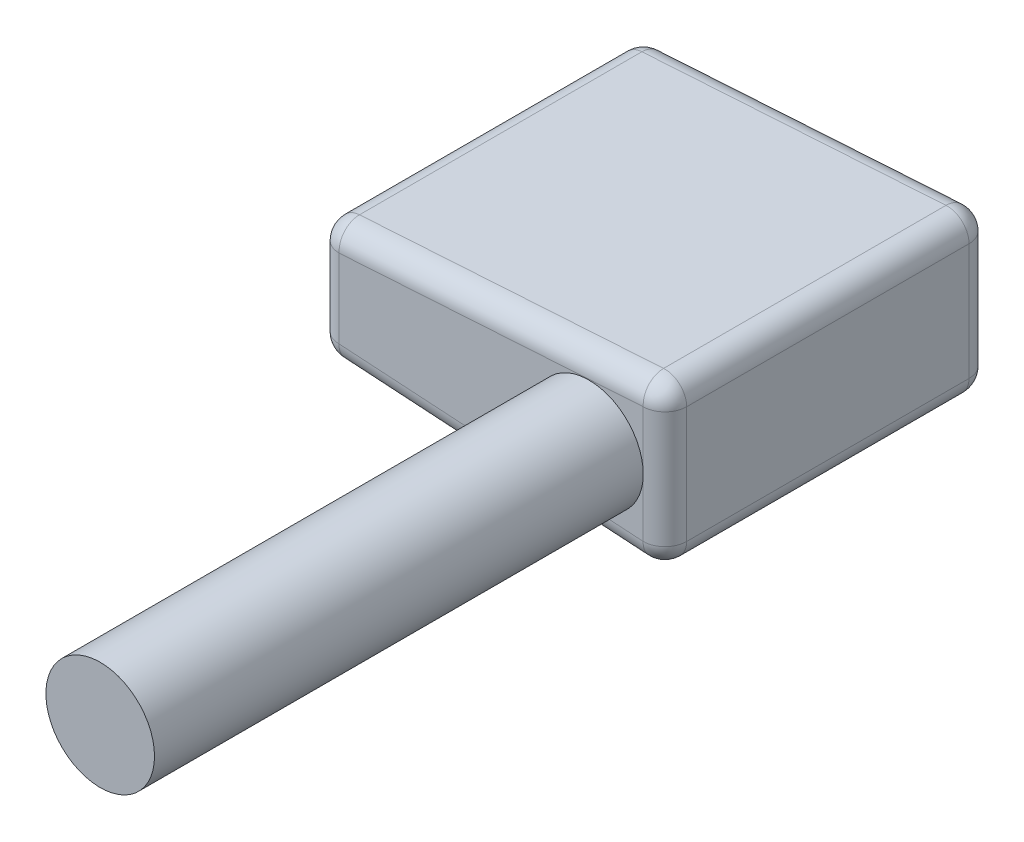
ISO-10303-21;
HEADER;
FILE_DESCRIPTION(('STEP AP214'),'2;1');
FILE_NAME('part.step','',(''),(''),'','','');
FILE_SCHEMA(('AUTOMOTIVE_DESIGN { 1 0 10303 214 1 1 1 1 }'));
ENDSEC;
DATA;
#1=APPLICATION_CONTEXT('core data for automotive mechanical design processes');
#2=APPLICATION_PROTOCOL_DEFINITION('international standard','automotive_design',2000,#1);
#3=PRODUCT_CONTEXT('',#1,'mechanical');
#4=PRODUCT('Part','Part','',(#3));
#5=PRODUCT_RELATED_PRODUCT_CATEGORY('part','',(#4));
#6=PRODUCT_DEFINITION_FORMATION('','',#4);
#7=PRODUCT_DEFINITION_CONTEXT('part definition',#1,'design');
#8=PRODUCT_DEFINITION('design','',#6,#7);
#9=PRODUCT_DEFINITION_SHAPE('','',#8);
#10=(LENGTH_UNIT() NAMED_UNIT(*) SI_UNIT(.MILLI.,.METRE.));
#11=(NAMED_UNIT(*) PLANE_ANGLE_UNIT() SI_UNIT($,.RADIAN.));
#12=(NAMED_UNIT(*) SI_UNIT($,.STERADIAN.) SOLID_ANGLE_UNIT());
#13=UNCERTAINTY_MEASURE_WITH_UNIT(LENGTH_MEASURE(1.E-05),#10,'distance_accuracy_value','');
#14=(GEOMETRIC_REPRESENTATION_CONTEXT(3) GLOBAL_UNCERTAINTY_ASSIGNED_CONTEXT((#13)) GLOBAL_UNIT_ASSIGNED_CONTEXT((#10,
#11,#12)) REPRESENTATION_CONTEXT('',''));
#15=CARTESIAN_POINT('',(0.,0.,0.));
#16=DIRECTION('',(0.,0.,1.));
#17=DIRECTION('',(1.,0.,0.));
#18=AXIS2_PLACEMENT_3D('',#15,#16,#17);
#19=CARTESIAN_POINT('',(-32.,2.,30.));
#20=DIRECTION('',(0.0623782861551804,0.998052578482889,0.));
#21=DIRECTION('',(-0.998052578482889,0.0623782861551804,0.));
#22=AXIS2_PLACEMENT_3D('',#19,#20,#21);
#23=PLANE('',#22);
#24=DIRECTION('',(0.998052578482889,-0.0623782861551804,0.));
#25=VECTOR('',#24,1.);
#26=CARTESIAN_POINT('',(-32.,2.,28.));
#27=LINE('',#26,#25);
#28=CARTESIAN_POINT('',(-2.12475657231036,0.132797285769398,28.));
#29=VERTEX_POINT('',#28);
#30=CARTESIAN_POINT('',(-30.1247565723104,1.88279728576939,28.));
#31=VERTEX_POINT('',#30);
#32=EDGE_CURVE('E186',#29,#31,#27,.F.);
#33=ORIENTED_EDGE('',*,*,#32,.T.);
#34=DIRECTION('',(0.,0.,-1.));
#35=VECTOR('',#34,1.);
#36=CARTESIAN_POINT('',(-30.1247565723104,1.88279728576939,30.));
#37=LINE('',#36,#35);
#38=CARTESIAN_POINT('',(-30.1247565723104,1.88279728576939,2.));
#39=VERTEX_POINT('',#38);
#40=EDGE_CURVE('E192',#31,#39,#37,.T.);
#41=ORIENTED_EDGE('',*,*,#40,.T.);
#42=DIRECTION('',(0.998052578482889,-0.0623782861551804,0.));
#43=VECTOR('',#42,1.);
#44=CARTESIAN_POINT('',(-32.,2.,2.));
#45=LINE('',#44,#43);
#46=CARTESIAN_POINT('',(-2.12475657231036,0.132797285769398,2.));
#47=VERTEX_POINT('',#46);
#48=EDGE_CURVE('E190',#39,#47,#45,.T.);
#49=ORIENTED_EDGE('',*,*,#48,.T.);
#50=DIRECTION('',(0.,0.,-1.));
#51=VECTOR('',#50,1.);
#52=CARTESIAN_POINT('',(-2.12475657231036,0.132797285769397,30.));
#53=LINE('',#52,#51);
#54=EDGE_CURVE('E188',#47,#29,#53,.F.);
#55=ORIENTED_EDGE('',*,*,#54,.T.);
#56=EDGE_LOOP('',(#33,#41,#49,#55));
#57=FACE_BOUND('',#56,.T.);
#58=ADVANCED_FACE('F37',(#57),#23,.F.);
#59=CARTESIAN_POINT('',(0.,0.,30.));
#60=DIRECTION('',(-1.,0.,0.));
#61=DIRECTION('',(0.,0.,1.));
#62=AXIS2_PLACEMENT_3D('',#59,#60,#61);
#63=PLANE('',#62);
#64=DIRECTION('',(0.,1.,0.));
#65=VECTOR('',#64,1.);
#66=CARTESIAN_POINT('',(0.,0.,28.));
#67=LINE('',#66,#65);
#68=CARTESIAN_POINT('',(0.,12.8710975572648,28.));
#69=VERTEX_POINT('',#68);
#70=CARTESIAN_POINT('',(0.,2.12890244273517,28.));
#71=VERTEX_POINT('',#70);
#72=EDGE_CURVE('E149',#69,#71,#67,.F.);
#73=ORIENTED_EDGE('',*,*,#72,.T.);
#74=DIRECTION('',(0.,0.,-1.));
#75=VECTOR('',#74,1.);
#76=CARTESIAN_POINT('',(0.,2.12890244273517,30.));
#77=LINE('',#76,#75);
#78=CARTESIAN_POINT('',(0.,2.12890244273517,2.));
#79=VERTEX_POINT('',#78);
#80=EDGE_CURVE('E11',#71,#79,#77,.T.);
#81=ORIENTED_EDGE('',*,*,#80,.T.);
#82=DIRECTION('',(0.,1.,0.));
#83=VECTOR('',#82,1.);
#84=CARTESIAN_POINT('',(0.,0.,2.));
#85=LINE('',#84,#83);
#86=CARTESIAN_POINT('',(0.,12.8710975572648,2.));
#87=VERTEX_POINT('',#86);
#88=EDGE_CURVE('E46',#79,#87,#85,.T.);
#89=ORIENTED_EDGE('',*,*,#88,.T.);
#90=DIRECTION('',(0.,0.,-1.));
#91=VECTOR('',#90,1.);
#92=CARTESIAN_POINT('',(0.,12.8710975572648,30.));
#93=LINE('',#92,#91);
#94=EDGE_CURVE('E213',#87,#69,#93,.F.);
#95=ORIENTED_EDGE('',*,*,#94,.T.);
#96=EDGE_LOOP('',(#73,#81,#89,#95));
#97=FACE_BOUND('',#96,.T.);
#98=ADVANCED_FACE('F275',(#97),#63,.F.);
#99=CARTESIAN_POINT('',(-32.,13.,30.));
#100=DIRECTION('',(0.0623782861551807,-0.998052578482889,0.));
#101=DIRECTION('',(0.998052578482889,0.0623782861551807,0.));
#102=AXIS2_PLACEMENT_3D('',#99,#100,#101);
#103=PLANE('',#102);
#104=DIRECTION('',(0.,0.,-1.));
#105=VECTOR('',#104,1.);
#106=CARTESIAN_POINT('',(-2.12475657231036,14.8672027142306,30.));
#107=LINE('',#106,#105);
#108=CARTESIAN_POINT('',(-2.12475657231036,14.8672027142306,28.));
#109=VERTEX_POINT('',#108);
#110=CARTESIAN_POINT('',(-2.12475657231036,14.8672027142306,2.));
#111=VERTEX_POINT('',#110);
#112=EDGE_CURVE('E206',#109,#111,#107,.T.);
#113=ORIENTED_EDGE('',*,*,#112,.T.);
#114=DIRECTION('',(-0.998052578482889,-0.0623782861551807,0.));
#115=VECTOR('',#114,1.);
#116=CARTESIAN_POINT('',(-32.,13.,2.));
#117=LINE('',#116,#115);
#118=CARTESIAN_POINT('',(-30.1247565723104,13.1172027142306,2.));
#119=VERTEX_POINT('',#118);
#120=EDGE_CURVE('E211',#111,#119,#117,.T.);
#121=ORIENTED_EDGE('',*,*,#120,.T.);
#122=DIRECTION('',(0.,0.,-1.));
#123=VECTOR('',#122,1.);
#124=CARTESIAN_POINT('',(-30.1247565723104,13.1172027142306,30.));
#125=LINE('',#124,#123);
#126=CARTESIAN_POINT('',(-30.1247565723104,13.1172027142306,28.));
#127=VERTEX_POINT('',#126);
#128=EDGE_CURVE('E208',#119,#127,#125,.F.);
#129=ORIENTED_EDGE('',*,*,#128,.T.);
#130=DIRECTION('',(-0.998052578482889,-0.0623782861551807,0.));
#131=VECTOR('',#130,1.);
#132=CARTESIAN_POINT('',(0.,15.,28.));
#133=LINE('',#132,#131);
#134=EDGE_CURVE('E204',#127,#109,#133,.F.);
#135=ORIENTED_EDGE('',*,*,#134,.T.);
#136=EDGE_LOOP('',(#113,#121,#129,#135));
#137=FACE_BOUND('',#136,.T.);
#138=ADVANCED_FACE('F323',(#137),#103,.F.);
#139=CARTESIAN_POINT('',(-32.,13.,30.));
#140=DIRECTION('',(1.,0.,0.));
#141=DIRECTION('',(0.,0.,-1.));
#142=AXIS2_PLACEMENT_3D('',#139,#140,#141);
#143=PLANE('',#142);
#144=DIRECTION('',(0.,0.,-1.));
#145=VECTOR('',#144,1.);
#146=CARTESIAN_POINT('',(-32.,3.87890244273517,30.));
#147=LINE('',#146,#145);
#148=CARTESIAN_POINT('',(-32.,3.87890244273517,2.));
#149=VERTEX_POINT('',#148);
#150=CARTESIAN_POINT('',(-32.,3.87890244273517,28.));
#151=VERTEX_POINT('',#150);
#152=EDGE_CURVE('E181',#149,#151,#147,.F.);
#153=ORIENTED_EDGE('',*,*,#152,.T.);
#154=DIRECTION('',(0.,-1.,0.));
#155=VECTOR('',#154,1.);
#156=CARTESIAN_POINT('',(-32.,13.,28.));
#157=LINE('',#156,#155);
#158=CARTESIAN_POINT('',(-32.,11.1210975572648,28.));
#159=VERTEX_POINT('',#158);
#160=EDGE_CURVE('E183',#151,#159,#157,.F.);
#161=ORIENTED_EDGE('',*,*,#160,.T.);
#162=DIRECTION('',(0.,0.,-1.));
#163=VECTOR('',#162,1.);
#164=CARTESIAN_POINT('',(-32.,11.1210975572648,30.));
#165=LINE('',#164,#163);
#166=CARTESIAN_POINT('',(-32.,11.1210975572648,2.));
#167=VERTEX_POINT('',#166);
#168=EDGE_CURVE('E177',#159,#167,#165,.T.);
#169=ORIENTED_EDGE('',*,*,#168,.T.);
#170=DIRECTION('',(0.,-1.,0.));
#171=VECTOR('',#170,1.);
#172=CARTESIAN_POINT('',(-32.,13.,2.));
#173=LINE('',#172,#171);
#174=EDGE_CURVE('E179',#167,#149,#173,.T.);
#175=ORIENTED_EDGE('',*,*,#174,.T.);
#176=EDGE_LOOP('',(#153,#161,#169,#175));
#177=FACE_BOUND('',#176,.T.);
#178=ADVANCED_FACE('F355',(#177),#143,.F.);
#179=CARTESIAN_POINT('',(0.,0.,30.));
#180=DIRECTION('',(0.,0.,1.));
#181=DIRECTION('',(1.,0.,0.));
#182=AXIS2_PLACEMENT_3D('',#179,#180,#181);
#183=PLANE('',#182);
#184=DIRECTION('',(0.,1.,0.));
#185=VECTOR('',#184,1.);
#186=CARTESIAN_POINT('',(-2.,15.,30.));
#187=LINE('',#186,#185);
#188=CARTESIAN_POINT('',(-2.,2.12890244273517,30.));
#189=VERTEX_POINT('',#188);
#190=CARTESIAN_POINT('',(-2.,7.5,30.));
#191=VERTEX_POINT('',#190);
#192=EDGE_CURVE('E141',#189,#191,#187,.T.);
#193=ORIENTED_EDGE('',*,*,#192,.T.);
#194=CARTESIAN_POINT('',(-7.,7.5,30.));
#195=DIRECTION('',(0.,0.,1.));
#196=DIRECTION('',(1.,0.,0.));
#197=AXIS2_PLACEMENT_3D('',#194,#195,#196);
#198=CIRCLE('',#197,5.);
#199=EDGE_CURVE('E52',#191,#191,#198,.T.);
#200=ORIENTED_EDGE('',*,*,#199,.F.);
#201=CARTESIAN_POINT('',(-2.,12.8710975572648,30.));
#202=VERTEX_POINT('',#201);
#203=EDGE_CURVE('E131',#191,#202,#187,.T.);
#204=ORIENTED_EDGE('',*,*,#203,.T.);
#205=DIRECTION('',(-0.998052578482889,-0.0623782861551807,0.));
#206=VECTOR('',#205,1.);
#207=CARTESIAN_POINT('',(-31.8752434276897,11.0038948430342,30.));
#208=LINE('',#207,#206);
#209=CARTESIAN_POINT('',(-30.,11.1210975572648,30.));
#210=VERTEX_POINT('',#209);
#211=EDGE_CURVE('E137',#202,#210,#208,.T.);
#212=ORIENTED_EDGE('',*,*,#211,.T.);
#213=DIRECTION('',(0.,-1.,0.));
#214=VECTOR('',#213,1.);
#215=CARTESIAN_POINT('',(-30.,2.,30.));
#216=LINE('',#215,#214);
#217=CARTESIAN_POINT('',(-30.,3.87890244273517,30.));
#218=VERTEX_POINT('',#217);
#219=EDGE_CURVE('E175',#210,#218,#216,.T.);
#220=ORIENTED_EDGE('',*,*,#219,.T.);
#221=DIRECTION('',(0.998052578482889,-0.0623782861551804,0.));
#222=VECTOR('',#221,1.);
#223=CARTESIAN_POINT('',(0.124756572310361,1.99610515696578,30.));
#224=LINE('',#223,#222);
#225=EDGE_CURVE('E173',#218,#189,#224,.T.);
#226=ORIENTED_EDGE('',*,*,#225,.T.);
#227=EDGE_LOOP('',(#193,#200,#204,#212,#220,#226));
#228=FACE_BOUND('',#227,.T.);
#229=ADVANCED_FACE('F134',(#228),#183,.T.);
#230=CARTESIAN_POINT('',(0.,0.,0.));
#231=DIRECTION('',(0.,0.,1.));
#232=DIRECTION('',(1.,0.,0.));
#233=AXIS2_PLACEMENT_3D('',#230,#231,#232);
#234=PLANE('',#233);
#235=DIRECTION('',(0.998052578482889,-0.0623782861551804,0.));
#236=VECTOR('',#235,1.);
#237=CARTESIAN_POINT('',(0.124756572310361,1.99610515696578,0.));
#238=LINE('',#237,#236);
#239=CARTESIAN_POINT('',(-2.,2.12890244273517,0.));
#240=VERTEX_POINT('',#239);
#241=CARTESIAN_POINT('',(-30.,3.87890244273517,0.));
#242=VERTEX_POINT('',#241);
#243=EDGE_CURVE('E199',#240,#242,#238,.F.);
#244=ORIENTED_EDGE('',*,*,#243,.T.);
#245=DIRECTION('',(0.,-1.,0.));
#246=VECTOR('',#245,1.);
#247=CARTESIAN_POINT('',(-30.,0.,0.));
#248=LINE('',#247,#246);
#249=CARTESIAN_POINT('',(-30.,11.1210975572648,0.));
#250=VERTEX_POINT('',#249);
#251=EDGE_CURVE('E201',#242,#250,#248,.F.);
#252=ORIENTED_EDGE('',*,*,#251,.T.);
#253=DIRECTION('',(-0.998052578482889,-0.0623782861551807,0.));
#254=VECTOR('',#253,1.);
#255=CARTESIAN_POINT('',(-0.809095567767462,12.9455290842794,0.));
#256=LINE('',#255,#254);
#257=CARTESIAN_POINT('',(-2.,12.8710975572648,0.));
#258=VERTEX_POINT('',#257);
#259=EDGE_CURVE('E195',#250,#258,#256,.F.);
#260=ORIENTED_EDGE('',*,*,#259,.T.);
#261=DIRECTION('',(0.,1.,0.));
#262=VECTOR('',#261,1.);
#263=CARTESIAN_POINT('',(-2.,0.,0.));
#264=LINE('',#263,#262);
#265=EDGE_CURVE('E197',#258,#240,#264,.F.);
#266=ORIENTED_EDGE('',*,*,#265,.T.);
#267=EDGE_LOOP('',(#244,#252,#260,#266));
#268=FACE_BOUND('',#267,.T.);
#269=ADVANCED_FACE('F303',(#268),#234,.F.);
#270=CARTESIAN_POINT('',(-2.,0.,2.));
#271=DIRECTION('',(0.,1.,0.));
#272=DIRECTION('',(0.,0.,1.));
#273=AXIS2_PLACEMENT_3D('',#270,#271,#272);
#274=CYLINDRICAL_SURFACE('',#273,2.);
#275=CARTESIAN_POINT('',(-2.,12.8710975572648,2.));
#276=DIRECTION('',(0.,1.,0.));
#277=DIRECTION('',(0.,0.,1.));
#278=AXIS2_PLACEMENT_3D('',#275,#276,#277);
#279=CIRCLE('',#278,2.);
#280=EDGE_CURVE('E41',#87,#258,#279,.T.);
#281=ORIENTED_EDGE('',*,*,#280,.F.);
#282=ORIENTED_EDGE('',*,*,#88,.F.);
#283=CARTESIAN_POINT('',(-2.,2.12890244273517,2.));
#284=DIRECTION('',(0.,-1.,0.));
#285=DIRECTION('',(0.,0.,-1.));
#286=AXIS2_PLACEMENT_3D('',#283,#284,#285);
#287=CIRCLE('',#286,2.);
#288=EDGE_CURVE('E169',#240,#79,#287,.T.);
#289=ORIENTED_EDGE('',*,*,#288,.F.);
#290=ORIENTED_EDGE('',*,*,#265,.F.);
#291=EDGE_LOOP('',(#281,#282,#289,#290));
#292=FACE_BOUND('',#291,.T.);
#293=ADVANCED_FACE('F39',(#292),#274,.T.);
#294=CARTESIAN_POINT('',(-2.,12.8710975572648,2.));
#295=DIRECTION('',(0.,0.,-1.));
#296=DIRECTION('',(-1.,0.,0.));
#297=AXIS2_PLACEMENT_3D('',#294,#295,#296);
#298=SPHERICAL_SURFACE('',#297,2.);
#299=CARTESIAN_POINT('',(-2.,12.8710975572648,2.));
#300=DIRECTION('',(0.,0.,-1.));
#301=DIRECTION('',(-1.,0.,0.));
#302=AXIS2_PLACEMENT_3D('',#299,#300,#301);
#303=CIRCLE('',#302,2.);
#304=EDGE_CURVE('E259',#87,#111,#303,.F.);
#305=ORIENTED_EDGE('',*,*,#304,.F.);
#306=ORIENTED_EDGE('',*,*,#280,.T.);
#307=CARTESIAN_POINT('',(-2.,12.8710975572648,2.));
#308=DIRECTION('',(0.998052578482888,0.0623782861551817,0.));
#309=DIRECTION('',(-0.0623782861551817,0.998052578482889,0.));
#310=AXIS2_PLACEMENT_3D('',#307,#308,#309);
#311=CIRCLE('',#310,2.);
#312=EDGE_CURVE('E262',#111,#258,#311,.F.);
#313=ORIENTED_EDGE('',*,*,#312,.F.);
#314=EDGE_LOOP('',(#305,#306,#313));
#315=FACE_BOUND('',#314,.T.);
#316=ADVANCED_FACE('F317',(#315),#298,.T.);
#317=CARTESIAN_POINT('',(-2.,2.12890244273517,2.));
#318=DIRECTION('',(0.,0.,-1.));
#319=DIRECTION('',(0.,1.,0.));
#320=AXIS2_PLACEMENT_3D('',#317,#318,#319);
#321=SPHERICAL_SURFACE('',#320,2.);
#322=CARTESIAN_POINT('',(-2.,2.12890244273517,2.));
#323=DIRECTION('',(0.998052578482889,-0.0623782861551804,0.));
#324=DIRECTION('',(0.0623782861551804,0.998052578482889,0.));
#325=AXIS2_PLACEMENT_3D('',#322,#323,#324);
#326=CIRCLE('',#325,2.);
#327=EDGE_CURVE('E255',#240,#47,#326,.F.);
#328=ORIENTED_EDGE('',*,*,#327,.F.);
#329=ORIENTED_EDGE('',*,*,#288,.T.);
#330=CARTESIAN_POINT('',(-2.,2.12890244273517,2.));
#331=DIRECTION('',(0.,0.,-1.));
#332=DIRECTION('',(-1.,0.,0.));
#333=AXIS2_PLACEMENT_3D('',#330,#331,#332);
#334=CIRCLE('',#333,2.);
#335=EDGE_CURVE('E59',#47,#79,#334,.F.);
#336=ORIENTED_EDGE('',*,*,#335,.F.);
#337=EDGE_LOOP('',(#328,#329,#336));
#338=FACE_BOUND('',#337,.T.);
#339=ADVANCED_FACE('F268',(#338),#321,.T.);
#340=CARTESIAN_POINT('',(-31.8752434276896,11.0038948430342,2.));
#341=DIRECTION('',(-0.998052578482889,-0.0623782861551807,0.));
#342=DIRECTION('',(0.0623782861551807,-0.998052578482889,0.));
#343=AXIS2_PLACEMENT_3D('',#340,#341,#342);
#344=CYLINDRICAL_SURFACE('',#343,2.);
#345=ORIENTED_EDGE('',*,*,#312,.T.);
#346=ORIENTED_EDGE('',*,*,#259,.F.);
#347=CARTESIAN_POINT('',(-30.,11.1210975572648,2.));
#348=DIRECTION('',(-0.998052578482889,-0.0623782861551812,0.));
#349=DIRECTION('',(0.0623782861551812,-0.998052578482889,0.));
#350=AXIS2_PLACEMENT_3D('',#347,#348,#349);
#351=CIRCLE('',#350,2.);
#352=EDGE_CURVE('E250',#119,#250,#351,.T.);
#353=ORIENTED_EDGE('',*,*,#352,.F.);
#354=ORIENTED_EDGE('',*,*,#120,.F.);
#355=EDGE_LOOP('',(#345,#346,#353,#354));
#356=FACE_BOUND('',#355,.T.);
#357=ADVANCED_FACE('F313',(#356),#344,.T.);
#358=CARTESIAN_POINT('',(-2.,12.8710975572648,30.));
#359=DIRECTION('',(0.,0.,-1.));
#360=DIRECTION('',(-1.,0.,0.));
#361=AXIS2_PLACEMENT_3D('',#358,#359,#360);
#362=CYLINDRICAL_SURFACE('',#361,2.);
#363=ORIENTED_EDGE('',*,*,#304,.T.);
#364=ORIENTED_EDGE('',*,*,#112,.F.);
#365=CARTESIAN_POINT('',(-2.,12.8710975572648,28.));
#366=DIRECTION('',(0.,0.,1.));
#367=DIRECTION('',(1.,0.,0.));
#368=AXIS2_PLACEMENT_3D('',#365,#366,#367);
#369=CIRCLE('',#368,2.);
#370=EDGE_CURVE('E153',#69,#109,#369,.T.);
#371=ORIENTED_EDGE('',*,*,#370,.F.);
#372=ORIENTED_EDGE('',*,*,#94,.F.);
#373=EDGE_LOOP('',(#363,#364,#371,#372));
#374=FACE_BOUND('',#373,.T.);
#375=ADVANCED_FACE('F321',(#374),#362,.T.);
#376=CARTESIAN_POINT('',(-2.,0.,28.));
#377=DIRECTION('',(0.,-1.,0.));
#378=DIRECTION('',(0.,0.,-1.));
#379=AXIS2_PLACEMENT_3D('',#376,#377,#378);
#380=CYLINDRICAL_SURFACE('',#379,2.);
#381=CARTESIAN_POINT('',(-2.,2.12890244273517,28.));
#382=DIRECTION('',(0.,-1.,0.));
#383=DIRECTION('',(0.,0.,-1.));
#384=AXIS2_PLACEMENT_3D('',#381,#382,#383);
#385=CIRCLE('',#384,2.);
#386=EDGE_CURVE('E154',#71,#189,#385,.T.);
#387=ORIENTED_EDGE('',*,*,#386,.F.);
#388=ORIENTED_EDGE('',*,*,#72,.F.);
#389=CARTESIAN_POINT('',(-2.,12.8710975572648,28.));
#390=DIRECTION('',(0.,1.,0.));
#391=DIRECTION('',(-1.,0.,0.));
#392=AXIS2_PLACEMENT_3D('',#389,#390,#391);
#393=CIRCLE('',#392,2.);
#394=EDGE_CURVE('E145',#202,#69,#393,.T.);
#395=ORIENTED_EDGE('',*,*,#394,.F.);
#396=ORIENTED_EDGE('',*,*,#203,.F.);
#397=ORIENTED_EDGE('',*,*,#192,.F.);
#398=EDGE_LOOP('',(#387,#388,#395,#396,#397));
#399=FACE_BOUND('',#398,.T.);
#400=ADVANCED_FACE('F148',(#399),#380,.T.);
#401=CARTESIAN_POINT('',(-2.,2.12890244273517,30.));
#402=DIRECTION('',(0.,0.,-1.));
#403=DIRECTION('',(-1.,0.,0.));
#404=AXIS2_PLACEMENT_3D('',#401,#402,#403);
#405=CYLINDRICAL_SURFACE('',#404,2.);
#406=ORIENTED_EDGE('',*,*,#335,.T.);
#407=ORIENTED_EDGE('',*,*,#80,.F.);
#408=CARTESIAN_POINT('',(-2.,2.12890244273517,28.));
#409=DIRECTION('',(0.,0.,1.));
#410=DIRECTION('',(1.,0.,0.));
#411=AXIS2_PLACEMENT_3D('',#408,#409,#410);
#412=CIRCLE('',#411,2.);
#413=EDGE_CURVE('E244',#29,#71,#412,.T.);
#414=ORIENTED_EDGE('',*,*,#413,.F.);
#415=ORIENTED_EDGE('',*,*,#54,.F.);
#416=EDGE_LOOP('',(#406,#407,#414,#415));
#417=FACE_BOUND('',#416,.T.);
#418=ADVANCED_FACE('F277',(#417),#405,.T.);
#419=CARTESIAN_POINT('',(-31.8752434276896,3.99610515696577,2.));
#420=DIRECTION('',(0.998052578482889,-0.0623782861551804,0.));
#421=DIRECTION('',(0.0623782861551804,0.998052578482889,0.));
#422=AXIS2_PLACEMENT_3D('',#419,#420,#421);
#423=CYLINDRICAL_SURFACE('',#422,2.);
#424=ORIENTED_EDGE('',*,*,#327,.T.);
#425=ORIENTED_EDGE('',*,*,#48,.F.);
#426=CARTESIAN_POINT('',(-30.,3.87890244273517,2.));
#427=DIRECTION('',(-0.998052578482889,0.0623782861551812,0.));
#428=DIRECTION('',(-0.0623782861551812,-0.998052578482889,0.));
#429=AXIS2_PLACEMENT_3D('',#426,#427,#428);
#430=CIRCLE('',#429,2.);
#431=EDGE_CURVE('E241',#242,#39,#430,.T.);
#432=ORIENTED_EDGE('',*,*,#431,.F.);
#433=ORIENTED_EDGE('',*,*,#243,.F.);
#434=EDGE_LOOP('',(#424,#425,#432,#433));
#435=FACE_BOUND('',#434,.T.);
#436=ADVANCED_FACE('F300',(#435),#423,.T.);
#437=CARTESIAN_POINT('',(-30.,13.,2.));
#438=DIRECTION('',(0.,-1.,0.));
#439=DIRECTION('',(0.,0.,-1.));
#440=AXIS2_PLACEMENT_3D('',#437,#438,#439);
#441=CYLINDRICAL_SURFACE('',#440,2.);
#442=CARTESIAN_POINT('',(-30.,11.1210975572648,2.));
#443=DIRECTION('',(0.,1.,0.));
#444=DIRECTION('',(0.,0.,1.));
#445=AXIS2_PLACEMENT_3D('',#442,#443,#444);
#446=CIRCLE('',#445,2.);
#447=EDGE_CURVE('E252',#250,#167,#446,.T.);
#448=ORIENTED_EDGE('',*,*,#447,.F.);
#449=ORIENTED_EDGE('',*,*,#251,.F.);
#450=CARTESIAN_POINT('',(-30.,3.87890244273517,2.));
#451=DIRECTION('',(0.,-1.,0.));
#452=DIRECTION('',(0.,0.,-1.));
#453=AXIS2_PLACEMENT_3D('',#450,#451,#452);
#454=CIRCLE('',#453,2.);
#455=EDGE_CURVE('E238',#149,#242,#454,.T.);
#456=ORIENTED_EDGE('',*,*,#455,.F.);
#457=ORIENTED_EDGE('',*,*,#174,.F.);
#458=EDGE_LOOP('',(#448,#449,#456,#457));
#459=FACE_BOUND('',#458,.T.);
#460=ADVANCED_FACE('F306',(#459),#441,.T.);
#461=CARTESIAN_POINT('',(-30.,11.1210975572648,2.));
#462=DIRECTION('',(0.,0.,-1.));
#463=DIRECTION('',(-1.,0.,0.));
#464=AXIS2_PLACEMENT_3D('',#461,#462,#463);
#465=SPHERICAL_SURFACE('',#464,2.);
#466=ORIENTED_EDGE('',*,*,#352,.T.);
#467=ORIENTED_EDGE('',*,*,#447,.T.);
#468=CARTESIAN_POINT('',(-30.,11.1210975572648,2.));
#469=DIRECTION('',(0.,0.,-1.));
#470=DIRECTION('',(-1.,0.,0.));
#471=AXIS2_PLACEMENT_3D('',#468,#469,#470);
#472=CIRCLE('',#471,2.);
#473=EDGE_CURVE('E161',#119,#167,#472,.F.);
#474=ORIENTED_EDGE('',*,*,#473,.F.);
#475=EDGE_LOOP('',(#466,#467,#474));
#476=FACE_BOUND('',#475,.T.);
#477=ADVANCED_FACE('F428',(#476),#465,.T.);
#478=CARTESIAN_POINT('',(-2.,12.8710975572648,28.));
#479=DIRECTION('',(0.,0.,1.));
#480=DIRECTION('',(0.,-1.,0.));
#481=AXIS2_PLACEMENT_3D('',#478,#479,#480);
#482=SPHERICAL_SURFACE('',#481,2.);
#483=ORIENTED_EDGE('',*,*,#394,.T.);
#484=ORIENTED_EDGE('',*,*,#370,.T.);
#485=CARTESIAN_POINT('',(-2.,12.8710975572648,28.));
#486=DIRECTION('',(0.998052578482889,0.0623782861551808,0.));
#487=DIRECTION('',(-0.0623782861551808,0.998052578482889,0.));
#488=AXIS2_PLACEMENT_3D('',#485,#486,#487);
#489=CIRCLE('',#488,2.);
#490=EDGE_CURVE('E157',#202,#109,#489,.F.);
#491=ORIENTED_EDGE('',*,*,#490,.F.);
#492=EDGE_LOOP('',(#483,#484,#491));
#493=FACE_BOUND('',#492,.T.);
#494=ADVANCED_FACE('F158',(#493),#482,.T.);
#495=CARTESIAN_POINT('',(-2.,2.12890244273517,28.));
#496=DIRECTION('',(0.,0.,1.));
#497=DIRECTION('',(0.,-1.,0.));
#498=AXIS2_PLACEMENT_3D('',#495,#496,#497);
#499=SPHERICAL_SURFACE('',#498,2.);
#500=ORIENTED_EDGE('',*,*,#413,.T.);
#501=ORIENTED_EDGE('',*,*,#386,.T.);
#502=CARTESIAN_POINT('',(-2.,2.12890244273517,28.));
#503=DIRECTION('',(0.998052578482889,-0.0623782861551804,0.));
#504=DIRECTION('',(0.0623782861551804,0.998052578482889,0.));
#505=AXIS2_PLACEMENT_3D('',#502,#503,#504);
#506=CIRCLE('',#505,2.);
#507=EDGE_CURVE('E162',#29,#189,#506,.F.);
#508=ORIENTED_EDGE('',*,*,#507,.F.);
#509=EDGE_LOOP('',(#500,#501,#508));
#510=FACE_BOUND('',#509,.T.);
#511=ADVANCED_FACE('F280',(#510),#499,.T.);
#512=CARTESIAN_POINT('',(-30.,3.87890244273517,2.));
#513=DIRECTION('',(0.,0.,-1.));
#514=DIRECTION('',(-1.,0.,0.));
#515=AXIS2_PLACEMENT_3D('',#512,#513,#514);
#516=SPHERICAL_SURFACE('',#515,2.);
#517=ORIENTED_EDGE('',*,*,#455,.T.);
#518=ORIENTED_EDGE('',*,*,#431,.T.);
#519=CARTESIAN_POINT('',(-30.,3.87890244273517,2.));
#520=DIRECTION('',(0.,0.,-1.));
#521=DIRECTION('',(-1.,0.,0.));
#522=AXIS2_PLACEMENT_3D('',#519,#520,#521);
#523=CIRCLE('',#522,2.);
#524=EDGE_CURVE('E232',#149,#39,#523,.F.);
#525=ORIENTED_EDGE('',*,*,#524,.F.);
#526=EDGE_LOOP('',(#517,#518,#525));
#527=FACE_BOUND('',#526,.T.);
#528=ADVANCED_FACE('F297',(#527),#516,.T.);
#529=CARTESIAN_POINT('',(-30.,11.1210975572648,30.));
#530=DIRECTION('',(0.,0.,-1.));
#531=DIRECTION('',(-1.,0.,0.));
#532=AXIS2_PLACEMENT_3D('',#529,#530,#531);
#533=CYLINDRICAL_SURFACE('',#532,2.);
#534=ORIENTED_EDGE('',*,*,#473,.T.);
#535=ORIENTED_EDGE('',*,*,#168,.F.);
#536=CARTESIAN_POINT('',(-30.,11.1210975572648,28.));
#537=DIRECTION('',(0.,0.,1.));
#538=DIRECTION('',(1.,0.,0.));
#539=AXIS2_PLACEMENT_3D('',#536,#537,#538);
#540=CIRCLE('',#539,2.);
#541=EDGE_CURVE('E229',#127,#159,#540,.T.);
#542=ORIENTED_EDGE('',*,*,#541,.F.);
#543=ORIENTED_EDGE('',*,*,#128,.F.);
#544=EDGE_LOOP('',(#534,#535,#542,#543));
#545=FACE_BOUND('',#544,.T.);
#546=ADVANCED_FACE('F327',(#545),#533,.T.);
#547=CARTESIAN_POINT('',(-0.809095567767462,12.9455290842794,28.));
#548=DIRECTION('',(0.998052578482889,0.0623782861551807,0.));
#549=DIRECTION('',(-0.0623782861551807,0.998052578482889,0.));
#550=AXIS2_PLACEMENT_3D('',#547,#548,#549);
#551=CYLINDRICAL_SURFACE('',#550,2.);
#552=ORIENTED_EDGE('',*,*,#490,.T.);
#553=ORIENTED_EDGE('',*,*,#134,.F.);
#554=CARTESIAN_POINT('',(-30.,11.1210975572648,28.));
#555=DIRECTION('',(-0.998052578482889,-0.0623782861551813,0.));
#556=DIRECTION('',(0.0623782861551813,-0.998052578482889,0.));
#557=AXIS2_PLACEMENT_3D('',#554,#555,#556);
#558=CIRCLE('',#557,2.);
#559=EDGE_CURVE('E165',#210,#127,#558,.T.);
#560=ORIENTED_EDGE('',*,*,#559,.F.);
#561=ORIENTED_EDGE('',*,*,#211,.F.);
#562=EDGE_LOOP('',(#552,#553,#560,#561));
#563=FACE_BOUND('',#562,.T.);
#564=ADVANCED_FACE('F164',(#563),#551,.T.);
#565=CARTESIAN_POINT('',(0.124756572310361,1.99610515696578,28.));
#566=DIRECTION('',(-0.998052578482889,0.0623782861551804,0.));
#567=DIRECTION('',(-0.0623782861551804,-0.998052578482889,0.));
#568=AXIS2_PLACEMENT_3D('',#565,#566,#567);
#569=CYLINDRICAL_SURFACE('',#568,2.);
#570=ORIENTED_EDGE('',*,*,#507,.T.);
#571=ORIENTED_EDGE('',*,*,#225,.F.);
#572=CARTESIAN_POINT('',(-30.,3.87890244273517,28.));
#573=DIRECTION('',(-0.998052578482889,0.0623782861551812,0.));
#574=DIRECTION('',(-0.0623782861551812,-0.998052578482889,0.));
#575=AXIS2_PLACEMENT_3D('',#572,#573,#574);
#576=CIRCLE('',#575,2.);
#577=EDGE_CURVE('E225',#31,#218,#576,.T.);
#578=ORIENTED_EDGE('',*,*,#577,.F.);
#579=ORIENTED_EDGE('',*,*,#32,.F.);
#580=EDGE_LOOP('',(#570,#571,#578,#579));
#581=FACE_BOUND('',#580,.T.);
#582=ADVANCED_FACE('F285',(#581),#569,.T.);
#583=CARTESIAN_POINT('',(-30.,3.87890244273517,30.));
#584=DIRECTION('',(0.,0.,-1.));
#585=DIRECTION('',(-1.,0.,0.));
#586=AXIS2_PLACEMENT_3D('',#583,#584,#585);
#587=CYLINDRICAL_SURFACE('',#586,2.);
#588=ORIENTED_EDGE('',*,*,#524,.T.);
#589=ORIENTED_EDGE('',*,*,#40,.F.);
#590=CARTESIAN_POINT('',(-30.,3.87890244273517,28.));
#591=DIRECTION('',(0.,0.,1.));
#592=DIRECTION('',(1.,0.,0.));
#593=AXIS2_PLACEMENT_3D('',#590,#591,#592);
#594=CIRCLE('',#593,2.);
#595=EDGE_CURVE('E222',#151,#31,#594,.T.);
#596=ORIENTED_EDGE('',*,*,#595,.F.);
#597=ORIENTED_EDGE('',*,*,#152,.F.);
#598=EDGE_LOOP('',(#588,#589,#596,#597));
#599=FACE_BOUND('',#598,.T.);
#600=ADVANCED_FACE('F290',(#599),#587,.T.);
#601=CARTESIAN_POINT('',(-30.,11.1210975572648,28.));
#602=DIRECTION('',(0.,0.,1.));
#603=DIRECTION('',(0.,-1.,0.));
#604=AXIS2_PLACEMENT_3D('',#601,#602,#603);
#605=SPHERICAL_SURFACE('',#604,2.);
#606=ORIENTED_EDGE('',*,*,#559,.T.);
#607=ORIENTED_EDGE('',*,*,#541,.T.);
#608=CARTESIAN_POINT('',(-30.,11.1210975572648,28.));
#609=DIRECTION('',(0.,1.,0.));
#610=DIRECTION('',(0.,0.,1.));
#611=AXIS2_PLACEMENT_3D('',#608,#609,#610);
#612=CIRCLE('',#611,2.);
#613=EDGE_CURVE('E219',#210,#159,#612,.F.);
#614=ORIENTED_EDGE('',*,*,#613,.F.);
#615=EDGE_LOOP('',(#606,#607,#614));
#616=FACE_BOUND('',#615,.T.);
#617=ADVANCED_FACE('F330',(#616),#605,.T.);
#618=CARTESIAN_POINT('',(-30.,3.87890244273517,28.));
#619=DIRECTION('',(0.,0.,1.));
#620=DIRECTION('',(1.,0.,0.));
#621=AXIS2_PLACEMENT_3D('',#618,#619,#620);
#622=SPHERICAL_SURFACE('',#621,2.);
#623=ORIENTED_EDGE('',*,*,#595,.T.);
#624=ORIENTED_EDGE('',*,*,#577,.T.);
#625=CARTESIAN_POINT('',(-30.,3.87890244273517,28.));
#626=DIRECTION('',(0.,-1.,0.));
#627=DIRECTION('',(0.,0.,-1.));
#628=AXIS2_PLACEMENT_3D('',#625,#626,#627);
#629=CIRCLE('',#628,2.);
#630=EDGE_CURVE('E217',#151,#218,#629,.F.);
#631=ORIENTED_EDGE('',*,*,#630,.F.);
#632=EDGE_LOOP('',(#623,#624,#631));
#633=FACE_BOUND('',#632,.T.);
#634=ADVANCED_FACE('F336',(#633),#622,.T.);
#635=CARTESIAN_POINT('',(-30.,0.,28.));
#636=DIRECTION('',(0.,1.,0.));
#637=DIRECTION('',(0.,0.,1.));
#638=AXIS2_PLACEMENT_3D('',#635,#636,#637);
#639=CYLINDRICAL_SURFACE('',#638,2.);
#640=ORIENTED_EDGE('',*,*,#613,.T.);
#641=ORIENTED_EDGE('',*,*,#160,.F.);
#642=ORIENTED_EDGE('',*,*,#630,.T.);
#643=ORIENTED_EDGE('',*,*,#219,.F.);
#644=EDGE_LOOP('',(#640,#641,#642,#643));
#645=FACE_BOUND('',#644,.T.);
#646=ADVANCED_FACE('F333',(#645),#639,.T.);
#647=CARTESIAN_POINT('',(-7.,7.5,75.));
#648=DIRECTION('',(0.,0.,-1.));
#649=DIRECTION('',(-1.,0.,0.));
#650=AXIS2_PLACEMENT_3D('',#647,#648,#649);
#651=CYLINDRICAL_SURFACE('',#650,5.);
#652=CARTESIAN_POINT('',(-7.,7.5,75.));
#653=DIRECTION('',(0.,0.,1.));
#654=DIRECTION('',(1.,0.,0.));
#655=AXIS2_PLACEMENT_3D('',#652,#653,#654);
#656=CIRCLE('',#655,5.);
#657=CARTESIAN_POINT('',(-2.,7.5,75.));
#658=VERTEX_POINT('',#657);
#659=EDGE_CURVE('E220',#658,#658,#656,.T.);
#660=ORIENTED_EDGE('',*,*,#659,.F.);
#661=EDGE_LOOP('',(#660));
#662=FACE_BOUND('',#661,.T.);
#663=ORIENTED_EDGE('',*,*,#199,.T.);
#664=EDGE_LOOP('',(#663));
#665=FACE_BOUND('',#664,.T.);
#666=ADVANCED_FACE('F343',(#662,#665),#651,.T.);
#667=CARTESIAN_POINT('',(-7.,7.5,75.));
#668=DIRECTION('',(0.,0.,1.));
#669=DIRECTION('',(1.,0.,0.));
#670=AXIS2_PLACEMENT_3D('',#667,#668,#669);
#671=PLANE('',#670);
#672=ORIENTED_EDGE('',*,*,#659,.T.);
#673=EDGE_LOOP('',(#672));
#674=FACE_BOUND('',#673,.T.);
#675=ADVANCED_FACE('F365',(#674),#671,.T.);
#676=CLOSED_SHELL('',(#58,#98,#138,#178,#229,#269,#293,#316,#339,#357,#375,#400,#418,#436,#460,
#477,#494,#511,#528,#546,#564,#582,#600,#617,#634,#646,#666,#675));
#677=MANIFOLD_SOLID_BREP('B2',#676);
#678=ADVANCED_BREP_SHAPE_REPRESENTATION('',(#18,#677),#14);
#679=SHAPE_DEFINITION_REPRESENTATION(#9,#678);
ENDSEC;
END-ISO-10303-21;
